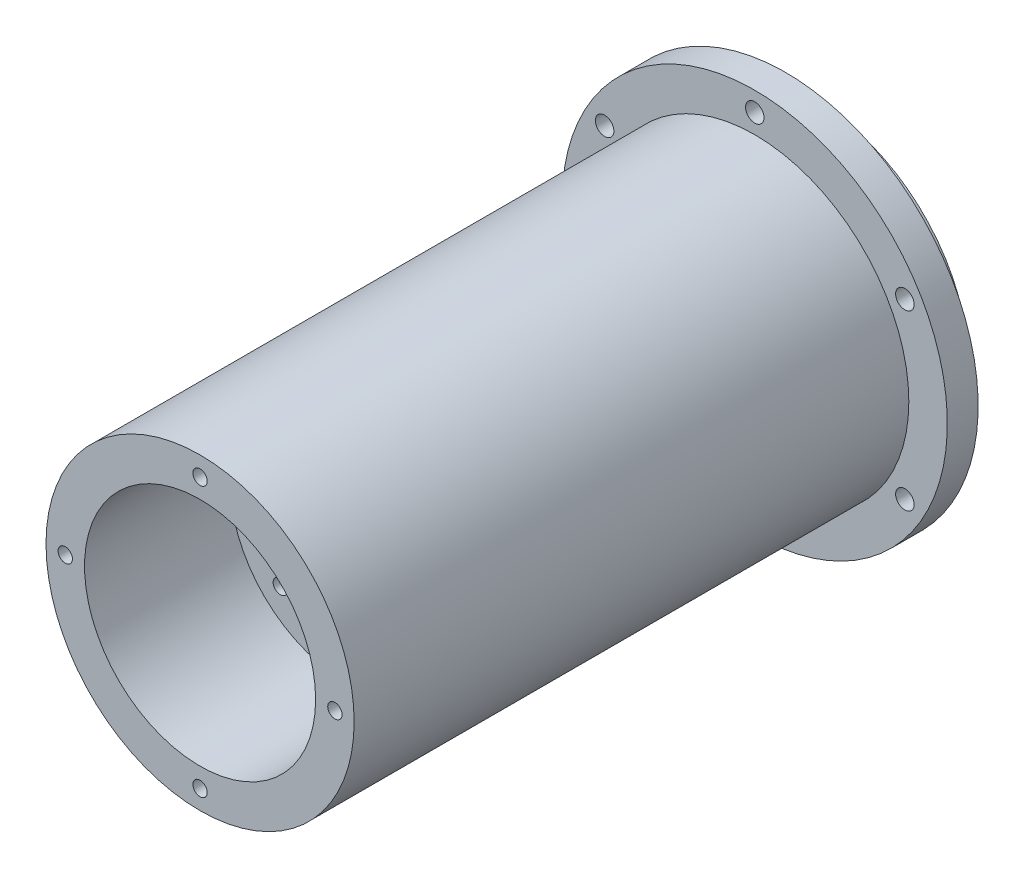
ISO-10303-21;
HEADER;
FILE_DESCRIPTION(('STEP AP214'),'2;1');
FILE_NAME('part.step','',(''),(''),'','','');
FILE_SCHEMA(('AUTOMOTIVE_DESIGN { 1 0 10303 214 1 1 1 1 }'));
ENDSEC;
DATA;
#1=APPLICATION_CONTEXT('core data for automotive mechanical design processes');
#2=APPLICATION_PROTOCOL_DEFINITION('international standard','automotive_design',2000,#1);
#3=PRODUCT_CONTEXT('',#1,'mechanical');
#4=PRODUCT('Part','Part','',(#3));
#5=PRODUCT_RELATED_PRODUCT_CATEGORY('part','',(#4));
#6=PRODUCT_DEFINITION_FORMATION('','',#4);
#7=PRODUCT_DEFINITION_CONTEXT('part definition',#1,'design');
#8=PRODUCT_DEFINITION('design','',#6,#7);
#9=PRODUCT_DEFINITION_SHAPE('','',#8);
#10=(LENGTH_UNIT() NAMED_UNIT(*) SI_UNIT(.MILLI.,.METRE.));
#11=(NAMED_UNIT(*) PLANE_ANGLE_UNIT() SI_UNIT($,.RADIAN.));
#12=(NAMED_UNIT(*) SI_UNIT($,.STERADIAN.) SOLID_ANGLE_UNIT());
#13=UNCERTAINTY_MEASURE_WITH_UNIT(LENGTH_MEASURE(1.E-05),#10,'distance_accuracy_value','');
#14=(GEOMETRIC_REPRESENTATION_CONTEXT(3) GLOBAL_UNCERTAINTY_ASSIGNED_CONTEXT((#13)) GLOBAL_UNIT_ASSIGNED_CONTEXT((#10,
#11,#12)) REPRESENTATION_CONTEXT('',''));
#15=CARTESIAN_POINT('',(0.,0.,0.));
#16=DIRECTION('',(0.,0.,1.));
#17=DIRECTION('',(1.,0.,0.));
#18=AXIS2_PLACEMENT_3D('',#15,#16,#17);
#19=CARTESIAN_POINT('',(0.,0.,-50.8));
#20=DIRECTION('',(0.,0.,1.));
#21=DIRECTION('',(1.,0.,0.));
#22=AXIS2_PLACEMENT_3D('',#19,#20,#21);
#23=CYLINDRICAL_SURFACE('',#22,9.6266);
#24=CARTESIAN_POINT('',(0.,0.,20.447));
#25=DIRECTION('',(0.,0.,1.));
#26=DIRECTION('',(1.,0.,0.));
#27=AXIS2_PLACEMENT_3D('',#24,#25,#26);
#28=CIRCLE('',#27,9.6266);
#29=CARTESIAN_POINT('',(9.6266,0.,20.447));
#30=VERTEX_POINT('',#29);
#31=EDGE_CURVE('E83',#30,#30,#28,.T.);
#32=ORIENTED_EDGE('',*,*,#31,.F.);
#33=EDGE_LOOP('',(#32));
#34=FACE_BOUND('',#33,.T.);
#35=CARTESIAN_POINT('',(0.,0.,25.4));
#36=DIRECTION('',(0.,0.,1.));
#37=DIRECTION('',(1.,0.,0.));
#38=AXIS2_PLACEMENT_3D('',#35,#36,#37);
#39=CIRCLE('',#38,9.6266);
#40=CARTESIAN_POINT('',(9.6266,0.,25.4));
#41=VERTEX_POINT('',#40);
#42=EDGE_CURVE('E41',#41,#41,#39,.F.);
#43=ORIENTED_EDGE('',*,*,#42,.F.);
#44=EDGE_LOOP('',(#43));
#45=FACE_BOUND('',#44,.T.);
#46=ADVANCED_FACE('F37',(#34,#45),#23,.F.);
#47=CARTESIAN_POINT('',(0.,0.,50.8));
#48=DIRECTION('',(0.,0.,-1.));
#49=DIRECTION('',(-1.,0.,0.));
#50=AXIS2_PLACEMENT_3D('',#47,#48,#49);
#51=CYLINDRICAL_SURFACE('',#50,31.75);
#52=CARTESIAN_POINT('',(0.,0.,-40.64));
#53=DIRECTION('',(0.,0.,-1.));
#54=DIRECTION('',(-1.,0.,0.));
#55=AXIS2_PLACEMENT_3D('',#52,#53,#54);
#56=CIRCLE('',#55,31.75);
#57=CARTESIAN_POINT('',(-31.75,0.,-40.64));
#58=VERTEX_POINT('',#57);
#59=EDGE_CURVE('E72',#58,#58,#56,.F.);
#60=ORIENTED_EDGE('',*,*,#59,.F.);
#61=EDGE_LOOP('',(#60));
#62=FACE_BOUND('',#61,.T.);
#63=CARTESIAN_POINT('',(0.,0.,-45.72));
#64=DIRECTION('',(0.,0.,-1.));
#65=DIRECTION('',(-1.,0.,0.));
#66=AXIS2_PLACEMENT_3D('',#63,#64,#65);
#67=CIRCLE('',#66,31.75);
#68=CARTESIAN_POINT('',(-31.75,0.,-45.72));
#69=VERTEX_POINT('',#68);
#70=EDGE_CURVE('E11',#69,#69,#67,.T.);
#71=ORIENTED_EDGE('',*,*,#70,.F.);
#72=EDGE_LOOP('',(#71));
#73=FACE_BOUND('',#72,.T.);
#74=ADVANCED_FACE('F39',(#62,#73),#51,.T.);
#75=CARTESIAN_POINT('',(0.,0.,-45.72));
#76=DIRECTION('',(0.,0.,-1.));
#77=DIRECTION('',(-1.,0.,0.));
#78=AXIS2_PLACEMENT_3D('',#75,#76,#77);
#79=PLANE('',#78);
#80=CARTESIAN_POINT('',(24.7466759131402,14.2875000000003,-45.72));
#81=DIRECTION('',(0.,0.,-1.));
#82=DIRECTION('',(-1.,0.,0.));
#83=AXIS2_PLACEMENT_3D('',#80,#81,#82);
#84=CIRCLE('',#83,1.524);
#85=CARTESIAN_POINT('',(23.2226759131402,14.2875000000003,-45.72));
#86=VERTEX_POINT('',#85);
#87=EDGE_CURVE('E127',#86,#86,#84,.T.);
#88=ORIENTED_EDGE('',*,*,#87,.F.);
#89=EDGE_LOOP('',(#88));
#90=FACE_BOUND('',#89,.T.);
#91=CARTESIAN_POINT('',(24.7466759131405,-14.2874999999998,-45.72));
#92=DIRECTION('',(0.,0.,-1.));
#93=DIRECTION('',(-1.,0.,0.));
#94=AXIS2_PLACEMENT_3D('',#91,#92,#93);
#95=CIRCLE('',#94,1.524);
#96=CARTESIAN_POINT('',(23.2226759131405,-14.2874999999998,-45.72));
#97=VERTEX_POINT('',#96);
#98=EDGE_CURVE('E121',#97,#97,#95,.T.);
#99=ORIENTED_EDGE('',*,*,#98,.F.);
#100=EDGE_LOOP('',(#99));
#101=FACE_BOUND('',#100,.T.);
#102=CARTESIAN_POINT('',(0.,-28.575,-45.72));
#103=DIRECTION('',(0.,0.,-1.));
#104=DIRECTION('',(-1.,0.,0.));
#105=AXIS2_PLACEMENT_3D('',#102,#103,#104);
#106=CIRCLE('',#105,1.524);
#107=CARTESIAN_POINT('',(-1.524,-28.575,-45.72));
#108=VERTEX_POINT('',#107);
#109=EDGE_CURVE('E113',#108,#108,#106,.T.);
#110=ORIENTED_EDGE('',*,*,#109,.F.);
#111=EDGE_LOOP('',(#110));
#112=FACE_BOUND('',#111,.T.);
#113=CARTESIAN_POINT('',(-24.7466759131403,-14.2875000000001,-45.72));
#114=DIRECTION('',(0.,0.,-1.));
#115=DIRECTION('',(-1.,0.,0.));
#116=AXIS2_PLACEMENT_3D('',#113,#114,#115);
#117=CIRCLE('',#116,1.524);
#118=CARTESIAN_POINT('',(-26.2706759131403,-14.2875000000001,-45.72));
#119=VERTEX_POINT('',#118);
#120=EDGE_CURVE('E106',#119,#119,#117,.T.);
#121=ORIENTED_EDGE('',*,*,#120,.F.);
#122=EDGE_LOOP('',(#121));
#123=FACE_BOUND('',#122,.T.);
#124=CARTESIAN_POINT('',(-24.7466759131404,14.2874999999999,-45.72));
#125=DIRECTION('',(0.,0.,-1.));
#126=DIRECTION('',(-1.,0.,0.));
#127=AXIS2_PLACEMENT_3D('',#124,#125,#126);
#128=CIRCLE('',#127,1.524);
#129=CARTESIAN_POINT('',(-26.2706759131404,14.2874999999999,-45.72));
#130=VERTEX_POINT('',#129);
#131=EDGE_CURVE('E98',#130,#130,#128,.T.);
#132=ORIENTED_EDGE('',*,*,#131,.F.);
#133=EDGE_LOOP('',(#132));
#134=FACE_BOUND('',#133,.T.);
#135=CARTESIAN_POINT('',(0.,28.575,-45.72));
#136=DIRECTION('',(0.,0.,-1.));
#137=DIRECTION('',(-1.,0.,0.));
#138=AXIS2_PLACEMENT_3D('',#135,#136,#137);
#139=CIRCLE('',#138,1.524);
#140=CARTESIAN_POINT('',(-1.524,28.575,-45.72));
#141=VERTEX_POINT('',#140);
#142=EDGE_CURVE('E90',#141,#141,#139,.T.);
#143=ORIENTED_EDGE('',*,*,#142,.F.);
#144=EDGE_LOOP('',(#143));
#145=FACE_BOUND('',#144,.T.);
#146=CARTESIAN_POINT('',(0.,0.,-45.72));
#147=DIRECTION('',(0.,0.,-1.));
#148=DIRECTION('',(-1.,0.,0.));
#149=AXIS2_PLACEMENT_3D('',#146,#147,#148);
#150=CIRCLE('',#149,25.0825);
#151=CARTESIAN_POINT('',(-25.0825,0.,-45.72));
#152=VERTEX_POINT('',#151);
#153=EDGE_CURVE('E46',#152,#152,#150,.T.);
#154=ORIENTED_EDGE('',*,*,#153,.F.);
#155=EDGE_LOOP('',(#154));
#156=FACE_BOUND('',#155,.T.);
#157=ORIENTED_EDGE('',*,*,#70,.T.);
#158=EDGE_LOOP('',(#157));
#159=FACE_BOUND('',#158,.T.);
#160=ADVANCED_FACE('F254',(#90,#101,#112,#123,#134,#145,#156,#159),#79,.T.);
#161=CARTESIAN_POINT('',(0.,0.,-45.72));
#162=DIRECTION('',(0.,0.,-1.));
#163=DIRECTION('',(-1.,0.,0.));
#164=AXIS2_PLACEMENT_3D('',#161,#162,#163);
#165=CYLINDRICAL_SURFACE('',#164,25.0825);
#166=ORIENTED_EDGE('',*,*,#153,.T.);
#167=EDGE_LOOP('',(#166));
#168=FACE_BOUND('',#167,.T.);
#169=CARTESIAN_POINT('',(0.,0.,-50.8));
#170=DIRECTION('',(0.,0.,-1.));
#171=DIRECTION('',(-1.,0.,0.));
#172=AXIS2_PLACEMENT_3D('',#169,#170,#171);
#173=CIRCLE('',#172,25.0825);
#174=CARTESIAN_POINT('',(-25.0825,0.,-50.8));
#175=VERTEX_POINT('',#174);
#176=EDGE_CURVE('E53',#175,#175,#173,.T.);
#177=ORIENTED_EDGE('',*,*,#176,.F.);
#178=EDGE_LOOP('',(#177));
#179=FACE_BOUND('',#178,.T.);
#180=ADVANCED_FACE('F521',(#168,#179),#165,.T.);
#181=CARTESIAN_POINT('',(0.,0.,-50.8));
#182=DIRECTION('',(0.,0.,1.));
#183=DIRECTION('',(1.,0.,0.));
#184=AXIS2_PLACEMENT_3D('',#181,#182,#183);
#185=PLANE('',#184);
#186=CARTESIAN_POINT('',(0.,0.,-50.8));
#187=DIRECTION('',(0.,0.,-1.));
#188=DIRECTION('',(-1.,0.,0.));
#189=AXIS2_PLACEMENT_3D('',#186,#187,#188);
#190=CIRCLE('',#189,22.5425);
#191=CARTESIAN_POINT('',(-22.5425,0.,-50.8));
#192=VERTEX_POINT('',#191);
#193=EDGE_CURVE('E63',#192,#192,#190,.T.);
#194=ORIENTED_EDGE('',*,*,#193,.F.);
#195=EDGE_LOOP('',(#194));
#196=FACE_BOUND('',#195,.T.);
#197=ORIENTED_EDGE('',*,*,#176,.T.);
#198=EDGE_LOOP('',(#197));
#199=FACE_BOUND('',#198,.T.);
#200=ADVANCED_FACE('F510',(#196,#199),#185,.F.);
#201=CARTESIAN_POINT('',(0.,0.,20.447));
#202=DIRECTION('',(0.,0.,1.));
#203=DIRECTION('',(1.,0.,0.));
#204=AXIS2_PLACEMENT_3D('',#201,#202,#203);
#205=PLANE('',#204);
#206=CARTESIAN_POINT('',(10.7763073452828,10.7763073452832,20.447));
#207=DIRECTION('',(0.,0.,1.));
#208=DIRECTION('',(1.,0.,0.));
#209=AXIS2_PLACEMENT_3D('',#206,#207,#208);
#210=CIRCLE('',#209,1.1811);
#211=CARTESIAN_POINT('',(11.9574073452828,10.7763073452832,20.447));
#212=VERTEX_POINT('',#211);
#213=EDGE_CURVE('E192',#212,#212,#210,.T.);
#214=ORIENTED_EDGE('',*,*,#213,.T.);
#215=EDGE_LOOP('',(#214));
#216=FACE_BOUND('',#215,.T.);
#217=CARTESIAN_POINT('',(10.776307345283,-10.7763073452829,20.447));
#218=DIRECTION('',(0.,0.,1.));
#219=DIRECTION('',(1.,0.,0.));
#220=AXIS2_PLACEMENT_3D('',#217,#218,#219);
#221=CIRCLE('',#220,1.1811);
#222=CARTESIAN_POINT('',(11.957407345283,-10.7763073452829,20.447));
#223=VERTEX_POINT('',#222);
#224=EDGE_CURVE('E184',#223,#223,#221,.T.);
#225=ORIENTED_EDGE('',*,*,#224,.T.);
#226=EDGE_LOOP('',(#225));
#227=FACE_BOUND('',#226,.T.);
#228=CARTESIAN_POINT('',(-10.7763073452829,-10.7763073452831,20.447));
#229=DIRECTION('',(0.,0.,1.));
#230=DIRECTION('',(1.,0.,0.));
#231=AXIS2_PLACEMENT_3D('',#228,#229,#230);
#232=CIRCLE('',#231,1.1811);
#233=CARTESIAN_POINT('',(-9.59520734528288,-10.7763073452831,20.447));
#234=VERTEX_POINT('',#233);
#235=EDGE_CURVE('E178',#234,#234,#232,.T.);
#236=ORIENTED_EDGE('',*,*,#235,.T.);
#237=EDGE_LOOP('',(#236));
#238=FACE_BOUND('',#237,.T.);
#239=CARTESIAN_POINT('',(-10.776307345283,10.7763073452829,20.447));
#240=DIRECTION('',(0.,0.,1.));
#241=DIRECTION('',(1.,0.,0.));
#242=AXIS2_PLACEMENT_3D('',#239,#240,#241);
#243=CIRCLE('',#242,1.1811);
#244=CARTESIAN_POINT('',(-9.59520734528304,10.7763073452829,20.447));
#245=VERTEX_POINT('',#244);
#246=EDGE_CURVE('E167',#245,#245,#243,.T.);
#247=ORIENTED_EDGE('',*,*,#246,.T.);
#248=EDGE_LOOP('',(#247));
#249=FACE_BOUND('',#248,.T.);
#250=ORIENTED_EDGE('',*,*,#31,.T.);
#251=EDGE_LOOP('',(#250));
#252=FACE_BOUND('',#251,.T.);
#253=CARTESIAN_POINT('',(0.,0.,20.447));
#254=DIRECTION('',(0.,0.,1.));
#255=DIRECTION('',(1.,0.,0.));
#256=AXIS2_PLACEMENT_3D('',#253,#254,#255);
#257=CIRCLE('',#256,22.5425);
#258=CARTESIAN_POINT('',(22.5425,0.,20.447));
#259=VERTEX_POINT('',#258);
#260=EDGE_CURVE('E58',#259,#259,#257,.F.);
#261=ORIENTED_EDGE('',*,*,#260,.T.);
#262=EDGE_LOOP('',(#261));
#263=FACE_BOUND('',#262,.T.);
#264=ADVANCED_FACE('F435',(#216,#227,#238,#249,#252,#263),#205,.F.);
#265=CARTESIAN_POINT('',(0.,0.,114.559818459591));
#266=DIRECTION('',(0.,0.,-1.));
#267=DIRECTION('',(-1.,0.,0.));
#268=AXIS2_PLACEMENT_3D('',#265,#266,#267);
#269=CYLINDRICAL_SURFACE('',#268,22.5425);
#270=ORIENTED_EDGE('',*,*,#193,.T.);
#271=EDGE_LOOP('',(#270));
#272=FACE_BOUND('',#271,.T.);
#273=ORIENTED_EDGE('',*,*,#260,.F.);
#274=EDGE_LOOP('',(#273));
#275=FACE_BOUND('',#274,.T.);
#276=ADVANCED_FACE('F236',(#272,#275),#269,.F.);
#277=CARTESIAN_POINT('',(0.,0.,-135.522561210691));
#278=DIRECTION('',(0.,0.,1.));
#279=DIRECTION('',(1.,0.,0.));
#280=AXIS2_PLACEMENT_3D('',#277,#278,#279);
#281=CYLINDRICAL_SURFACE('',#280,25.4);
#282=CARTESIAN_POINT('',(0.,0.,50.8));
#283=DIRECTION('',(0.,0.,1.));
#284=DIRECTION('',(1.,0.,0.));
#285=AXIS2_PLACEMENT_3D('',#282,#283,#284);
#286=CIRCLE('',#285,25.4);
#287=CARTESIAN_POINT('',(25.4,0.,50.8));
#288=VERTEX_POINT('',#287);
#289=EDGE_CURVE('E71',#288,#288,#286,.T.);
#290=ORIENTED_EDGE('',*,*,#289,.F.);
#291=EDGE_LOOP('',(#290));
#292=FACE_BOUND('',#291,.T.);
#293=CARTESIAN_POINT('',(0.,0.,-40.64));
#294=DIRECTION('',(0.,0.,-1.));
#295=DIRECTION('',(-1.,0.,0.));
#296=AXIS2_PLACEMENT_3D('',#293,#294,#295);
#297=CIRCLE('',#296,25.4);
#298=CARTESIAN_POINT('',(-25.4,0.,-40.64));
#299=VERTEX_POINT('',#298);
#300=EDGE_CURVE('E67',#299,#299,#297,.F.);
#301=ORIENTED_EDGE('',*,*,#300,.T.);
#302=EDGE_LOOP('',(#301));
#303=FACE_BOUND('',#302,.T.);
#304=ADVANCED_FACE('F233',(#292,#303),#281,.T.);
#305=CARTESIAN_POINT('',(0.,0.,-40.64));
#306=DIRECTION('',(0.,0.,-1.));
#307=DIRECTION('',(-1.,0.,0.));
#308=AXIS2_PLACEMENT_3D('',#305,#306,#307);
#309=PLANE('',#308);
#310=CARTESIAN_POINT('',(24.7466759131402,14.2875000000003,-40.64));
#311=DIRECTION('',(0.,0.,1.));
#312=DIRECTION('',(0.50000000000001,-0.866025403784433,0.));
#313=AXIS2_PLACEMENT_3D('',#310,#311,#312);
#314=CIRCLE('',#313,1.524);
#315=CARTESIAN_POINT('',(25.5086759131402,12.9676772846328,-40.64));
#316=VERTEX_POINT('',#315);
#317=EDGE_CURVE('E130',#316,#316,#314,.T.);
#318=ORIENTED_EDGE('',*,*,#317,.F.);
#319=EDGE_LOOP('',(#318));
#320=FACE_BOUND('',#319,.T.);
#321=CARTESIAN_POINT('',(24.7466759131405,-14.2874999999998,-40.64));
#322=DIRECTION('',(0.,0.,1.));
#323=DIRECTION('',(-0.499999999999992,-0.866025403784443,0.));
#324=AXIS2_PLACEMENT_3D('',#321,#322,#323);
#325=CIRCLE('',#324,1.524);
#326=CARTESIAN_POINT('',(23.9846759131405,-15.6073227153673,-40.64));
#327=VERTEX_POINT('',#326);
#328=EDGE_CURVE('E124',#327,#327,#325,.T.);
#329=ORIENTED_EDGE('',*,*,#328,.F.);
#330=EDGE_LOOP('',(#329));
#331=FACE_BOUND('',#330,.T.);
#332=CARTESIAN_POINT('',(0.,-28.575,-40.64));
#333=DIRECTION('',(0.,0.,1.));
#334=DIRECTION('',(-1.,0.,0.));
#335=AXIS2_PLACEMENT_3D('',#332,#333,#334);
#336=CIRCLE('',#335,1.524);
#337=CARTESIAN_POINT('',(-1.524,-28.575,-40.64));
#338=VERTEX_POINT('',#337);
#339=EDGE_CURVE('E117',#338,#338,#336,.T.);
#340=ORIENTED_EDGE('',*,*,#339,.F.);
#341=EDGE_LOOP('',(#340));
#342=FACE_BOUND('',#341,.T.);
#343=CARTESIAN_POINT('',(-24.7466759131403,-14.2875000000001,-40.64));
#344=DIRECTION('',(0.,0.,1.));
#345=DIRECTION('',(-0.500000000000004,0.866025403784436,0.));
#346=AXIS2_PLACEMENT_3D('',#343,#344,#345);
#347=CIRCLE('',#346,1.524);
#348=CARTESIAN_POINT('',(-25.5086759131403,-12.9676772846326,-40.64));
#349=VERTEX_POINT('',#348);
#350=EDGE_CURVE('E110',#349,#349,#347,.T.);
#351=ORIENTED_EDGE('',*,*,#350,.F.);
#352=EDGE_LOOP('',(#351));
#353=FACE_BOUND('',#352,.T.);
#354=CARTESIAN_POINT('',(-24.7466759131404,14.2874999999999,-40.64));
#355=DIRECTION('',(0.,0.,1.));
#356=DIRECTION('',(0.499999999999998,0.86602540378444,0.));
#357=AXIS2_PLACEMENT_3D('',#354,#355,#356);
#358=CIRCLE('',#357,1.524);
#359=CARTESIAN_POINT('',(-23.9846759131404,15.6073227153674,-40.64));
#360=VERTEX_POINT('',#359);
#361=EDGE_CURVE('E102',#360,#360,#358,.T.);
#362=ORIENTED_EDGE('',*,*,#361,.F.);
#363=EDGE_LOOP('',(#362));
#364=FACE_BOUND('',#363,.T.);
#365=CARTESIAN_POINT('',(0.,28.575,-40.64));
#366=DIRECTION('',(0.,0.,1.));
#367=DIRECTION('',(1.,0.,0.));
#368=AXIS2_PLACEMENT_3D('',#365,#366,#367);
#369=CIRCLE('',#368,1.524);
#370=CARTESIAN_POINT('',(1.524,28.575,-40.64));
#371=VERTEX_POINT('',#370);
#372=EDGE_CURVE('E94',#371,#371,#369,.T.);
#373=ORIENTED_EDGE('',*,*,#372,.F.);
#374=EDGE_LOOP('',(#373));
#375=FACE_BOUND('',#374,.T.);
#376=ORIENTED_EDGE('',*,*,#59,.T.);
#377=EDGE_LOOP('',(#376));
#378=FACE_BOUND('',#377,.T.);
#379=ORIENTED_EDGE('',*,*,#300,.F.);
#380=EDGE_LOOP('',(#379));
#381=FACE_BOUND('',#380,.T.);
#382=ADVANCED_FACE('F228',(#320,#331,#342,#353,#364,#375,#378,#381),#309,.F.);
#383=CARTESIAN_POINT('',(0.,0.,50.8));
#384=DIRECTION('',(0.,0.,1.));
#385=DIRECTION('',(1.,0.,0.));
#386=AXIS2_PLACEMENT_3D('',#383,#384,#385);
#387=PLANE('',#386);
#388=CARTESIAN_POINT('',(22.225,2.32794518267366E-13,50.8));
#389=DIRECTION('',(0.,0.,1.));
#390=DIRECTION('',(0.,-1.,0.));
#391=AXIS2_PLACEMENT_3D('',#388,#389,#390);
#392=CIRCLE('',#391,1.1811);
#393=CARTESIAN_POINT('',(22.225,-1.18109999999977,50.8));
#394=VERTEX_POINT('',#393);
#395=EDGE_CURVE('E155',#394,#394,#392,.T.);
#396=ORIENTED_EDGE('',*,*,#395,.F.);
#397=EDGE_LOOP('',(#396));
#398=FACE_BOUND('',#397,.T.);
#399=CARTESIAN_POINT('',(0.,-22.225,50.8));
#400=DIRECTION('',(0.,0.,1.));
#401=DIRECTION('',(-1.,0.,0.));
#402=AXIS2_PLACEMENT_3D('',#399,#400,#401);
#403=CIRCLE('',#402,1.1811);
#404=CARTESIAN_POINT('',(-1.1811,-22.225,50.8));
#405=VERTEX_POINT('',#404);
#406=EDGE_CURVE('E149',#405,#405,#403,.T.);
#407=ORIENTED_EDGE('',*,*,#406,.F.);
#408=EDGE_LOOP('',(#407));
#409=FACE_BOUND('',#408,.T.);
#410=CARTESIAN_POINT('',(-22.225,0.,50.8));
#411=DIRECTION('',(0.,0.,1.));
#412=DIRECTION('',(0.,1.,0.));
#413=AXIS2_PLACEMENT_3D('',#410,#411,#412);
#414=CIRCLE('',#413,1.1811);
#415=CARTESIAN_POINT('',(-22.225,1.18109999999992,50.8));
#416=VERTEX_POINT('',#415);
#417=EDGE_CURVE('E143',#416,#416,#414,.T.);
#418=ORIENTED_EDGE('',*,*,#417,.F.);
#419=EDGE_LOOP('',(#418));
#420=FACE_BOUND('',#419,.T.);
#421=CARTESIAN_POINT('',(0.,22.225,50.8));
#422=DIRECTION('',(0.,0.,1.));
#423=DIRECTION('',(1.,0.,0.));
#424=AXIS2_PLACEMENT_3D('',#421,#422,#423);
#425=CIRCLE('',#424,1.1811);
#426=CARTESIAN_POINT('',(1.1811,22.225,50.8));
#427=VERTEX_POINT('',#426);
#428=EDGE_CURVE('E135',#427,#427,#425,.T.);
#429=ORIENTED_EDGE('',*,*,#428,.F.);
#430=EDGE_LOOP('',(#429));
#431=FACE_BOUND('',#430,.T.);
#432=CARTESIAN_POINT('',(0.,0.,50.8));
#433=DIRECTION('',(0.,0.,1.));
#434=DIRECTION('',(1.,0.,0.));
#435=AXIS2_PLACEMENT_3D('',#432,#433,#434);
#436=CIRCLE('',#435,19.05);
#437=CARTESIAN_POINT('',(19.05,0.,50.8));
#438=VERTEX_POINT('',#437);
#439=EDGE_CURVE('E79',#438,#438,#436,.T.);
#440=ORIENTED_EDGE('',*,*,#439,.F.);
#441=EDGE_LOOP('',(#440));
#442=FACE_BOUND('',#441,.T.);
#443=ORIENTED_EDGE('',*,*,#289,.T.);
#444=EDGE_LOOP('',(#443));
#445=FACE_BOUND('',#444,.T.);
#446=ADVANCED_FACE('F222',(#398,#409,#420,#431,#442,#445),#387,.T.);
#447=CARTESIAN_POINT('',(0.,0.,26.797));
#448=DIRECTION('',(0.,0.,1.));
#449=DIRECTION('',(1.,0.,0.));
#450=AXIS2_PLACEMENT_3D('',#447,#448,#449);
#451=CYLINDRICAL_SURFACE('',#450,19.05);
#452=CARTESIAN_POINT('',(0.,0.,26.797));
#453=DIRECTION('',(0.,0.,1.));
#454=DIRECTION('',(1.,0.,0.));
#455=AXIS2_PLACEMENT_3D('',#452,#453,#454);
#456=CIRCLE('',#455,19.05);
#457=CARTESIAN_POINT('',(19.05,0.,26.797));
#458=VERTEX_POINT('',#457);
#459=EDGE_CURVE('E75',#458,#458,#456,.T.);
#460=ORIENTED_EDGE('',*,*,#459,.F.);
#461=EDGE_LOOP('',(#460));
#462=FACE_BOUND('',#461,.T.);
#463=ORIENTED_EDGE('',*,*,#439,.T.);
#464=EDGE_LOOP('',(#463));
#465=FACE_BOUND('',#464,.T.);
#466=ADVANCED_FACE('F208',(#462,#465),#451,.F.);
#467=CARTESIAN_POINT('',(0.,0.,26.797));
#468=DIRECTION('',(0.,0.,1.));
#469=DIRECTION('',(1.,0.,0.));
#470=AXIS2_PLACEMENT_3D('',#467,#468,#469);
#471=PLANE('',#470);
#472=CARTESIAN_POINT('',(10.7763073452828,10.7763073452832,26.797));
#473=DIRECTION('',(0.,0.,1.));
#474=DIRECTION('',(0.,-1.,0.));
#475=AXIS2_PLACEMENT_3D('',#472,#473,#474);
#476=CIRCLE('',#475,1.1811);
#477=CARTESIAN_POINT('',(10.7763073452828,9.59520734528316,26.797));
#478=VERTEX_POINT('',#477);
#479=EDGE_CURVE('E196',#478,#478,#476,.T.);
#480=ORIENTED_EDGE('',*,*,#479,.F.);
#481=EDGE_LOOP('',(#480));
#482=FACE_BOUND('',#481,.T.);
#483=CARTESIAN_POINT('',(10.776307345283,-10.7763073452829,26.797));
#484=DIRECTION('',(0.,0.,1.));
#485=DIRECTION('',(-1.,0.,0.));
#486=AXIS2_PLACEMENT_3D('',#483,#484,#485);
#487=CIRCLE('',#486,1.1811);
#488=CARTESIAN_POINT('',(9.59520734528304,-10.7763073452829,26.797));
#489=VERTEX_POINT('',#488);
#490=EDGE_CURVE('E188',#489,#489,#487,.T.);
#491=ORIENTED_EDGE('',*,*,#490,.F.);
#492=EDGE_LOOP('',(#491));
#493=FACE_BOUND('',#492,.T.);
#494=CARTESIAN_POINT('',(-10.7763073452829,-10.7763073452831,26.797));
#495=DIRECTION('',(0.,0.,1.));
#496=DIRECTION('',(0.,1.,0.));
#497=AXIS2_PLACEMENT_3D('',#494,#495,#496);
#498=CIRCLE('',#497,1.1811);
#499=CARTESIAN_POINT('',(-10.7763073452829,-9.59520734528308,26.797));
#500=VERTEX_POINT('',#499);
#501=EDGE_CURVE('E181',#500,#500,#498,.T.);
#502=ORIENTED_EDGE('',*,*,#501,.F.);
#503=EDGE_LOOP('',(#502));
#504=FACE_BOUND('',#503,.T.);
#505=CARTESIAN_POINT('',(-10.776307345283,10.7763073452829,26.797));
#506=DIRECTION('',(0.,0.,1.));
#507=DIRECTION('',(1.,0.,0.));
#508=AXIS2_PLACEMENT_3D('',#505,#506,#507);
#509=CIRCLE('',#508,1.1811);
#510=CARTESIAN_POINT('',(-9.59520734528304,10.7763073452829,26.797));
#511=VERTEX_POINT('',#510);
#512=EDGE_CURVE('E174',#511,#511,#509,.T.);
#513=ORIENTED_EDGE('',*,*,#512,.F.);
#514=EDGE_LOOP('',(#513));
#515=FACE_BOUND('',#514,.T.);
#516=CARTESIAN_POINT('',(0.,0.,26.797));
#517=DIRECTION('',(0.,0.,1.));
#518=DIRECTION('',(1.,0.,0.));
#519=AXIS2_PLACEMENT_3D('',#516,#517,#518);
#520=CIRCLE('',#519,11.303);
#521=CARTESIAN_POINT('',(11.303,0.,26.797));
#522=VERTEX_POINT('',#521);
#523=EDGE_CURVE('E162',#522,#522,#520,.T.);
#524=ORIENTED_EDGE('',*,*,#523,.F.);
#525=EDGE_LOOP('',(#524));
#526=FACE_BOUND('',#525,.T.);
#527=ORIENTED_EDGE('',*,*,#459,.T.);
#528=EDGE_LOOP('',(#527));
#529=FACE_BOUND('',#528,.T.);
#530=ADVANCED_FACE('F204',(#482,#493,#504,#515,#526,#529),#471,.T.);
#531=CARTESIAN_POINT('',(0.,28.575,-50.8));
#532=DIRECTION('',(0.,0.,1.));
#533=DIRECTION('',(1.,0.,0.));
#534=AXIS2_PLACEMENT_3D('',#531,#532,#533);
#535=CYLINDRICAL_SURFACE('',#534,1.524);
#536=ORIENTED_EDGE('',*,*,#142,.T.);
#537=EDGE_LOOP('',(#536));
#538=FACE_BOUND('',#537,.T.);
#539=ORIENTED_EDGE('',*,*,#372,.T.);
#540=EDGE_LOOP('',(#539));
#541=FACE_BOUND('',#540,.T.);
#542=ADVANCED_FACE('F207',(#538,#541),#535,.F.);
#543=CARTESIAN_POINT('',(-24.7466759131404,14.2874999999999,-50.8));
#544=DIRECTION('',(0.,0.,1.));
#545=DIRECTION('',(1.,0.,0.));
#546=AXIS2_PLACEMENT_3D('',#543,#544,#545);
#547=CYLINDRICAL_SURFACE('',#546,1.524);
#548=ORIENTED_EDGE('',*,*,#131,.T.);
#549=EDGE_LOOP('',(#548));
#550=FACE_BOUND('',#549,.T.);
#551=ORIENTED_EDGE('',*,*,#361,.T.);
#552=EDGE_LOOP('',(#551));
#553=FACE_BOUND('',#552,.T.);
#554=ADVANCED_FACE('F261',(#550,#553),#547,.F.);
#555=CARTESIAN_POINT('',(-24.7466759131403,-14.2875000000001,-50.8));
#556=DIRECTION('',(0.,0.,1.));
#557=DIRECTION('',(1.,0.,0.));
#558=AXIS2_PLACEMENT_3D('',#555,#556,#557);
#559=CYLINDRICAL_SURFACE('',#558,1.524);
#560=ORIENTED_EDGE('',*,*,#120,.T.);
#561=EDGE_LOOP('',(#560));
#562=FACE_BOUND('',#561,.T.);
#563=ORIENTED_EDGE('',*,*,#350,.T.);
#564=EDGE_LOOP('',(#563));
#565=FACE_BOUND('',#564,.T.);
#566=ADVANCED_FACE('F265',(#562,#565),#559,.F.);
#567=CARTESIAN_POINT('',(0.,-28.575,-50.8));
#568=DIRECTION('',(0.,0.,1.));
#569=DIRECTION('',(1.,0.,0.));
#570=AXIS2_PLACEMENT_3D('',#567,#568,#569);
#571=CYLINDRICAL_SURFACE('',#570,1.524);
#572=ORIENTED_EDGE('',*,*,#109,.T.);
#573=EDGE_LOOP('',(#572));
#574=FACE_BOUND('',#573,.T.);
#575=ORIENTED_EDGE('',*,*,#339,.T.);
#576=EDGE_LOOP('',(#575));
#577=FACE_BOUND('',#576,.T.);
#578=ADVANCED_FACE('F269',(#574,#577),#571,.F.);
#579=CARTESIAN_POINT('',(24.7466759131405,-14.2874999999998,-50.8));
#580=DIRECTION('',(0.,0.,1.));
#581=DIRECTION('',(1.,0.,0.));
#582=AXIS2_PLACEMENT_3D('',#579,#580,#581);
#583=CYLINDRICAL_SURFACE('',#582,1.524);
#584=ORIENTED_EDGE('',*,*,#98,.T.);
#585=EDGE_LOOP('',(#584));
#586=FACE_BOUND('',#585,.T.);
#587=ORIENTED_EDGE('',*,*,#328,.T.);
#588=EDGE_LOOP('',(#587));
#589=FACE_BOUND('',#588,.T.);
#590=ADVANCED_FACE('F273',(#586,#589),#583,.F.);
#591=CARTESIAN_POINT('',(24.7466759131402,14.2875000000003,-50.8));
#592=DIRECTION('',(0.,0.,1.));
#593=DIRECTION('',(1.,0.,0.));
#594=AXIS2_PLACEMENT_3D('',#591,#592,#593);
#595=CYLINDRICAL_SURFACE('',#594,1.524);
#596=ORIENTED_EDGE('',*,*,#87,.T.);
#597=EDGE_LOOP('',(#596));
#598=FACE_BOUND('',#597,.T.);
#599=ORIENTED_EDGE('',*,*,#317,.T.);
#600=EDGE_LOOP('',(#599));
#601=FACE_BOUND('',#600,.T.);
#602=ADVANCED_FACE('F277',(#598,#601),#595,.F.);
#603=CARTESIAN_POINT('',(0.,22.225,38.1));
#604=DIRECTION('',(0.,0.,1.));
#605=DIRECTION('',(1.,0.,0.));
#606=AXIS2_PLACEMENT_3D('',#603,#604,#605);
#607=CYLINDRICAL_SURFACE('',#606,1.1811);
#608=CARTESIAN_POINT('',(0.,22.225,38.1));
#609=DIRECTION('',(0.,0.,1.));
#610=DIRECTION('',(1.,0.,0.));
#611=AXIS2_PLACEMENT_3D('',#608,#609,#610);
#612=CIRCLE('',#611,1.1811);
#613=CARTESIAN_POINT('',(1.1811,22.225,38.1));
#614=VERTEX_POINT('',#613);
#615=EDGE_CURVE('E134',#614,#614,#612,.T.);
#616=ORIENTED_EDGE('',*,*,#615,.F.);
#617=EDGE_LOOP('',(#616));
#618=FACE_BOUND('',#617,.T.);
#619=ORIENTED_EDGE('',*,*,#428,.T.);
#620=EDGE_LOOP('',(#619));
#621=FACE_BOUND('',#620,.T.);
#622=ADVANCED_FACE('F281',(#618,#621),#607,.F.);
#623=CARTESIAN_POINT('',(0.,22.225,38.1));
#624=DIRECTION('',(0.,0.,1.));
#625=DIRECTION('',(1.,0.,0.));
#626=AXIS2_PLACEMENT_3D('',#623,#624,#625);
#627=PLANE('',#626);
#628=ORIENTED_EDGE('',*,*,#615,.T.);
#629=EDGE_LOOP('',(#628));
#630=FACE_BOUND('',#629,.T.);
#631=ADVANCED_FACE('F285',(#630),#627,.T.);
#632=CARTESIAN_POINT('',(-22.225,0.,38.1));
#633=DIRECTION('',(0.,0.,1.));
#634=DIRECTION('',(1.,0.,0.));
#635=AXIS2_PLACEMENT_3D('',#632,#633,#634);
#636=CYLINDRICAL_SURFACE('',#635,1.1811);
#637=CARTESIAN_POINT('',(-22.225,0.,38.1));
#638=DIRECTION('',(0.,0.,1.));
#639=DIRECTION('',(0.,1.,0.));
#640=AXIS2_PLACEMENT_3D('',#637,#638,#639);
#641=CIRCLE('',#640,1.1811);
#642=CARTESIAN_POINT('',(-22.225,1.18109999999992,38.1));
#643=VERTEX_POINT('',#642);
#644=EDGE_CURVE('E139',#643,#643,#641,.T.);
#645=ORIENTED_EDGE('',*,*,#644,.F.);
#646=EDGE_LOOP('',(#645));
#647=FACE_BOUND('',#646,.T.);
#648=ORIENTED_EDGE('',*,*,#417,.T.);
#649=EDGE_LOOP('',(#648));
#650=FACE_BOUND('',#649,.T.);
#651=ADVANCED_FACE('F289',(#647,#650),#636,.F.);
#652=CARTESIAN_POINT('',(-22.225,0.,38.1));
#653=DIRECTION('',(0.,0.,1.));
#654=DIRECTION('',(0.,1.,0.));
#655=AXIS2_PLACEMENT_3D('',#652,#653,#654);
#656=PLANE('',#655);
#657=ORIENTED_EDGE('',*,*,#644,.T.);
#658=EDGE_LOOP('',(#657));
#659=FACE_BOUND('',#658,.T.);
#660=ADVANCED_FACE('F293',(#659),#656,.T.);
#661=CARTESIAN_POINT('',(0.,-22.225,38.1));
#662=DIRECTION('',(0.,0.,1.));
#663=DIRECTION('',(1.,0.,0.));
#664=AXIS2_PLACEMENT_3D('',#661,#662,#663);
#665=CYLINDRICAL_SURFACE('',#664,1.1811);
#666=CARTESIAN_POINT('',(0.,-22.225,38.1));
#667=DIRECTION('',(0.,0.,1.));
#668=DIRECTION('',(-1.,0.,0.));
#669=AXIS2_PLACEMENT_3D('',#666,#667,#668);
#670=CIRCLE('',#669,1.1811);
#671=CARTESIAN_POINT('',(-1.1811,-22.225,38.1));
#672=VERTEX_POINT('',#671);
#673=EDGE_CURVE('E146',#672,#672,#670,.T.);
#674=ORIENTED_EDGE('',*,*,#673,.F.);
#675=EDGE_LOOP('',(#674));
#676=FACE_BOUND('',#675,.T.);
#677=ORIENTED_EDGE('',*,*,#406,.T.);
#678=EDGE_LOOP('',(#677));
#679=FACE_BOUND('',#678,.T.);
#680=ADVANCED_FACE('F297',(#676,#679),#665,.F.);
#681=CARTESIAN_POINT('',(0.,-22.225,38.1));
#682=DIRECTION('',(0.,0.,1.));
#683=DIRECTION('',(-1.,0.,0.));
#684=AXIS2_PLACEMENT_3D('',#681,#682,#683);
#685=PLANE('',#684);
#686=ORIENTED_EDGE('',*,*,#673,.T.);
#687=EDGE_LOOP('',(#686));
#688=FACE_BOUND('',#687,.T.);
#689=ADVANCED_FACE('F301',(#688),#685,.T.);
#690=CARTESIAN_POINT('',(22.225,2.32794518267366E-13,38.1));
#691=DIRECTION('',(0.,0.,1.));
#692=DIRECTION('',(1.,0.,0.));
#693=AXIS2_PLACEMENT_3D('',#690,#691,#692);
#694=CYLINDRICAL_SURFACE('',#693,1.1811);
#695=CARTESIAN_POINT('',(22.225,2.32794518267366E-13,38.1));
#696=DIRECTION('',(0.,0.,1.));
#697=DIRECTION('',(0.,-1.,0.));
#698=AXIS2_PLACEMENT_3D('',#695,#696,#697);
#699=CIRCLE('',#698,1.1811);
#700=CARTESIAN_POINT('',(22.225,-1.18109999999977,38.1));
#701=VERTEX_POINT('',#700);
#702=EDGE_CURVE('E152',#701,#701,#699,.T.);
#703=ORIENTED_EDGE('',*,*,#702,.F.);
#704=EDGE_LOOP('',(#703));
#705=FACE_BOUND('',#704,.T.);
#706=ORIENTED_EDGE('',*,*,#395,.T.);
#707=EDGE_LOOP('',(#706));
#708=FACE_BOUND('',#707,.T.);
#709=ADVANCED_FACE('F305',(#705,#708),#694,.F.);
#710=CARTESIAN_POINT('',(22.225,2.32794518267366E-13,38.1));
#711=DIRECTION('',(0.,0.,1.));
#712=DIRECTION('',(0.,-1.,0.));
#713=AXIS2_PLACEMENT_3D('',#710,#711,#712);
#714=PLANE('',#713);
#715=ORIENTED_EDGE('',*,*,#702,.T.);
#716=EDGE_LOOP('',(#715));
#717=FACE_BOUND('',#716,.T.);
#718=ADVANCED_FACE('F309',(#717),#714,.T.);
#719=CARTESIAN_POINT('',(0.,0.,25.4));
#720=DIRECTION('',(0.,0.,1.));
#721=DIRECTION('',(1.,0.,0.));
#722=AXIS2_PLACEMENT_3D('',#719,#720,#721);
#723=PLANE('',#722);
#724=CARTESIAN_POINT('',(0.,0.,25.4));
#725=DIRECTION('',(0.,0.,1.));
#726=DIRECTION('',(1.,0.,0.));
#727=AXIS2_PLACEMENT_3D('',#724,#725,#726);
#728=CIRCLE('',#727,11.303);
#729=CARTESIAN_POINT('',(11.303,0.,25.4));
#730=VERTEX_POINT('',#729);
#731=EDGE_CURVE('E166',#730,#730,#728,.T.);
#732=ORIENTED_EDGE('',*,*,#731,.T.);
#733=EDGE_LOOP('',(#732));
#734=FACE_BOUND('',#733,.T.);
#735=ORIENTED_EDGE('',*,*,#42,.T.);
#736=EDGE_LOOP('',(#735));
#737=FACE_BOUND('',#736,.T.);
#738=ADVANCED_FACE('F313',(#734,#737),#723,.T.);
#739=CARTESIAN_POINT('',(0.,0.,25.4));
#740=DIRECTION('',(0.,0.,1.));
#741=DIRECTION('',(1.,0.,0.));
#742=AXIS2_PLACEMENT_3D('',#739,#740,#741);
#743=CYLINDRICAL_SURFACE('',#742,11.303);
#744=ORIENTED_EDGE('',*,*,#731,.F.);
#745=EDGE_LOOP('',(#744));
#746=FACE_BOUND('',#745,.T.);
#747=ORIENTED_EDGE('',*,*,#523,.T.);
#748=EDGE_LOOP('',(#747));
#749=FACE_BOUND('',#748,.T.);
#750=ADVANCED_FACE('F315',(#746,#749),#743,.F.);
#751=CARTESIAN_POINT('',(-10.776307345283,10.7763073452829,-50.8));
#752=DIRECTION('',(0.,0.,1.));
#753=DIRECTION('',(1.,0.,0.));
#754=AXIS2_PLACEMENT_3D('',#751,#752,#753);
#755=CYLINDRICAL_SURFACE('',#754,1.1811);
#756=ORIENTED_EDGE('',*,*,#512,.T.);
#757=EDGE_LOOP('',(#756));
#758=FACE_BOUND('',#757,.T.);
#759=ORIENTED_EDGE('',*,*,#246,.F.);
#760=EDGE_LOOP('',(#759));
#761=FACE_BOUND('',#760,.T.);
#762=ADVANCED_FACE('F318',(#758,#761),#755,.F.);
#763=CARTESIAN_POINT('',(-10.7763073452829,-10.7763073452831,-50.8));
#764=DIRECTION('',(0.,0.,1.));
#765=DIRECTION('',(1.,0.,0.));
#766=AXIS2_PLACEMENT_3D('',#763,#764,#765);
#767=CYLINDRICAL_SURFACE('',#766,1.1811);
#768=ORIENTED_EDGE('',*,*,#501,.T.);
#769=EDGE_LOOP('',(#768));
#770=FACE_BOUND('',#769,.T.);
#771=ORIENTED_EDGE('',*,*,#235,.F.);
#772=EDGE_LOOP('',(#771));
#773=FACE_BOUND('',#772,.T.);
#774=ADVANCED_FACE('F325',(#770,#773),#767,.F.);
#775=CARTESIAN_POINT('',(10.776307345283,-10.7763073452829,-50.8));
#776=DIRECTION('',(0.,0.,1.));
#777=DIRECTION('',(1.,0.,0.));
#778=AXIS2_PLACEMENT_3D('',#775,#776,#777);
#779=CYLINDRICAL_SURFACE('',#778,1.1811);
#780=ORIENTED_EDGE('',*,*,#490,.T.);
#781=EDGE_LOOP('',(#780));
#782=FACE_BOUND('',#781,.T.);
#783=ORIENTED_EDGE('',*,*,#224,.F.);
#784=EDGE_LOOP('',(#783));
#785=FACE_BOUND('',#784,.T.);
#786=ADVANCED_FACE('F329',(#782,#785),#779,.F.);
#787=CARTESIAN_POINT('',(10.7763073452828,10.7763073452832,-50.8));
#788=DIRECTION('',(0.,0.,1.));
#789=DIRECTION('',(1.,0.,0.));
#790=AXIS2_PLACEMENT_3D('',#787,#788,#789);
#791=CYLINDRICAL_SURFACE('',#790,1.1811);
#792=ORIENTED_EDGE('',*,*,#479,.T.);
#793=EDGE_LOOP('',(#792));
#794=FACE_BOUND('',#793,.T.);
#795=ORIENTED_EDGE('',*,*,#213,.F.);
#796=EDGE_LOOP('',(#795));
#797=FACE_BOUND('',#796,.T.);
#798=ADVANCED_FACE('F201',(#794,#797),#791,.F.);
#799=CLOSED_SHELL('',(#46,#74,#160,#180,#200,#264,#276,#304,#382,#446,#466,#530,#542,#554,#566,
#578,#590,#602,#622,#631,#651,#660,#680,#689,#709,#718,#738,#750,#762,#774,#786,#798));
#800=MANIFOLD_SOLID_BREP('B2',#799);
#801=ADVANCED_BREP_SHAPE_REPRESENTATION('',(#18,#800),#14);
#802=SHAPE_DEFINITION_REPRESENTATION(#9,#801);
ENDSEC;
END-ISO-10303-21;
